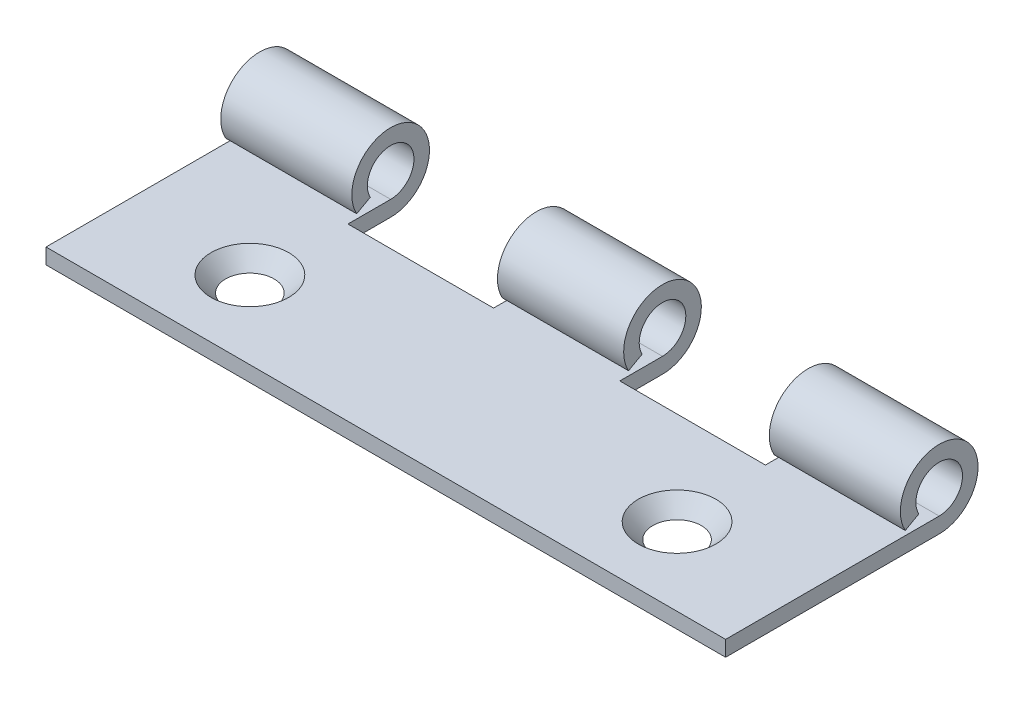
ISO-10303-21;
HEADER;
FILE_DESCRIPTION(('STEP AP214'),'2;1');
FILE_NAME('part.step','',(''),(''),'','','');
FILE_SCHEMA(('AUTOMOTIVE_DESIGN { 1 0 10303 214 1 1 1 1 }'));
ENDSEC;
DATA;
#1=APPLICATION_CONTEXT('core data for automotive mechanical design processes');
#2=APPLICATION_PROTOCOL_DEFINITION('international standard','automotive_design',2000,#1);
#3=PRODUCT_CONTEXT('',#1,'mechanical');
#4=PRODUCT('Part','Part','',(#3));
#5=PRODUCT_RELATED_PRODUCT_CATEGORY('part','',(#4));
#6=PRODUCT_DEFINITION_FORMATION('','',#4);
#7=PRODUCT_DEFINITION_CONTEXT('part definition',#1,'design');
#8=PRODUCT_DEFINITION('design','',#6,#7);
#9=PRODUCT_DEFINITION_SHAPE('','',#8);
#10=(LENGTH_UNIT() NAMED_UNIT(*) SI_UNIT(.MILLI.,.METRE.));
#11=(NAMED_UNIT(*) PLANE_ANGLE_UNIT() SI_UNIT($,.RADIAN.));
#12=(NAMED_UNIT(*) SI_UNIT($,.STERADIAN.) SOLID_ANGLE_UNIT());
#13=UNCERTAINTY_MEASURE_WITH_UNIT(LENGTH_MEASURE(1.E-05),#10,'distance_accuracy_value','');
#14=(GEOMETRIC_REPRESENTATION_CONTEXT(3) GLOBAL_UNCERTAINTY_ASSIGNED_CONTEXT((#13)) GLOBAL_UNIT_ASSIGNED_CONTEXT((#10,
#11,#12)) REPRESENTATION_CONTEXT('',''));
#15=CARTESIAN_POINT('',(0.,0.,0.));
#16=DIRECTION('',(0.,0.,1.));
#17=DIRECTION('',(1.,0.,0.));
#18=AXIS2_PLACEMENT_3D('',#15,#16,#17);
#19=CARTESIAN_POINT('',(0.,0.,0.));
#20=DIRECTION('',(1.,0.,0.));
#21=DIRECTION('',(0.,0.,-1.));
#22=AXIS2_PLACEMENT_3D('',#19,#20,#21);
#23=CYLINDRICAL_SURFACE('',#22,2.);
#24=CARTESIAN_POINT('',(28.25,0.,0.));
#25=DIRECTION('',(1.,0.,0.));
#26=DIRECTION('',(0.,0.,-1.));
#27=AXIS2_PLACEMENT_3D('',#24,#25,#26);
#28=CIRCLE('',#27,2.);
#29=CARTESIAN_POINT('',(28.25,-2.,0.));
#30=VERTEX_POINT('',#29);
#31=CARTESIAN_POINT('',(28.25,-0.969619240492674,1.74923941427879));
#32=VERTEX_POINT('',#31);
#33=EDGE_CURVE('E193',#30,#32,#28,.T.);
#34=ORIENTED_EDGE('',*,*,#33,.T.);
#35=DIRECTION('',(1.,0.,0.));
#36=VECTOR('',#35,1.);
#37=CARTESIAN_POINT('',(0.,-0.969619240492674,1.74923941427879));
#38=LINE('',#37,#36);
#39=CARTESIAN_POINT('',(35.,-0.969619240492674,1.74923941427879));
#40=VERTEX_POINT('',#39);
#41=EDGE_CURVE('E287',#32,#40,#38,.T.);
#42=ORIENTED_EDGE('',*,*,#41,.T.);
#43=CARTESIAN_POINT('',(35.,0.,0.));
#44=DIRECTION('',(-1.,0.,0.));
#45=DIRECTION('',(0.,0.,1.));
#46=AXIS2_PLACEMENT_3D('',#43,#44,#45);
#47=CIRCLE('',#46,2.);
#48=CARTESIAN_POINT('',(35.,-2.,0.));
#49=VERTEX_POINT('',#48);
#50=EDGE_CURVE('E244',#40,#49,#47,.T.);
#51=ORIENTED_EDGE('',*,*,#50,.T.);
#52=DIRECTION('',(1.,0.,0.));
#53=VECTOR('',#52,1.);
#54=CARTESIAN_POINT('',(0.,-2.,0.));
#55=LINE('',#54,#53);
#56=EDGE_CURVE('E314',#30,#49,#55,.T.);
#57=ORIENTED_EDGE('',*,*,#56,.F.);
#58=EDGE_LOOP('',(#34,#42,#51,#57));
#59=FACE_BOUND('',#58,.T.);
#60=ADVANCED_FACE('F15',(#59),#23,.T.);
#61=CARTESIAN_POINT('',(0.,0.,0.));
#62=DIRECTION('',(1.,0.,0.));
#63=DIRECTION('',(0.,0.,-1.));
#64=AXIS2_PLACEMENT_3D('',#61,#62,#63);
#65=CYLINDRICAL_SURFACE('',#64,1.2);
#66=CARTESIAN_POINT('',(28.25,0.,0.));
#67=DIRECTION('',(1.,0.,0.));
#68=DIRECTION('',(0.,0.,-1.));
#69=AXIS2_PLACEMENT_3D('',#66,#67,#68);
#70=CIRCLE('',#69,1.2);
#71=CARTESIAN_POINT('',(28.25,-1.2,0.));
#72=VERTEX_POINT('',#71);
#73=CARTESIAN_POINT('',(28.25,-0.581771544295605,1.04954364856727));
#74=VERTEX_POINT('',#73);
#75=EDGE_CURVE('E186',#72,#74,#70,.T.);
#76=ORIENTED_EDGE('',*,*,#75,.F.);
#77=DIRECTION('',(1.,0.,0.));
#78=VECTOR('',#77,1.);
#79=CARTESIAN_POINT('',(0.,-1.2,0.));
#80=LINE('',#79,#78);
#81=CARTESIAN_POINT('',(35.,-1.2,0.));
#82=VERTEX_POINT('',#81);
#83=EDGE_CURVE('E301',#72,#82,#80,.T.);
#84=ORIENTED_EDGE('',*,*,#83,.T.);
#85=CARTESIAN_POINT('',(35.,0.,0.));
#86=DIRECTION('',(-1.,0.,0.));
#87=DIRECTION('',(0.,0.,1.));
#88=AXIS2_PLACEMENT_3D('',#85,#86,#87);
#89=CIRCLE('',#88,1.2);
#90=CARTESIAN_POINT('',(35.,-0.581771544295604,1.04954364856727));
#91=VERTEX_POINT('',#90);
#92=EDGE_CURVE('E257',#91,#82,#89,.T.);
#93=ORIENTED_EDGE('',*,*,#92,.F.);
#94=DIRECTION('',(1.,0.,0.));
#95=VECTOR('',#94,1.);
#96=CARTESIAN_POINT('',(0.,-0.581771544295604,1.04954364856727));
#97=LINE('',#96,#95);
#98=EDGE_CURVE('E295',#74,#91,#97,.T.);
#99=ORIENTED_EDGE('',*,*,#98,.F.);
#100=EDGE_LOOP('',(#76,#84,#93,#99));
#101=FACE_BOUND('',#100,.T.);
#102=ADVANCED_FACE('F389',(#101),#65,.F.);
#103=CARTESIAN_POINT('',(0.,-0.581771544295604,1.04954364856727));
#104=DIRECTION('',(0.,0.874619707139396,0.484809620246337));
#105=DIRECTION('',(0.,0.484809620246337,-0.874619707139396));
#106=AXIS2_PLACEMENT_3D('',#103,#104,#105);
#107=PLANE('',#106);
#108=ORIENTED_EDGE('',*,*,#41,.F.);
#109=DIRECTION('',(0.,0.484809620246337,-0.874619707139396));
#110=VECTOR('',#109,1.);
#111=CARTESIAN_POINT('',(28.25,-0.581771544295603,1.04954364856727));
#112=LINE('',#111,#110);
#113=EDGE_CURVE('E189',#32,#74,#112,.T.);
#114=ORIENTED_EDGE('',*,*,#113,.T.);
#115=ORIENTED_EDGE('',*,*,#98,.T.);
#116=DIRECTION('',(0.,-0.484809620246337,0.874619707139396));
#117=VECTOR('',#116,1.);
#118=CARTESIAN_POINT('',(35.,-0.581771544295604,1.04954364856727));
#119=LINE('',#118,#117);
#120=EDGE_CURVE('E261',#91,#40,#119,.T.);
#121=ORIENTED_EDGE('',*,*,#120,.T.);
#122=EDGE_LOOP('',(#108,#114,#115,#121));
#123=FACE_BOUND('',#122,.T.);
#124=ADVANCED_FACE('F412',(#123),#107,.F.);
#125=CARTESIAN_POINT('',(14.25,-0.969619240492675,1.74923941427879));
#126=VERTEX_POINT('',#125);
#127=CARTESIAN_POINT('',(20.75,-0.969619240492675,1.74923941427879));
#128=VERTEX_POINT('',#127);
#129=EDGE_CURVE('E296',#126,#128,#38,.T.);
#130=ORIENTED_EDGE('',*,*,#129,.T.);
#131=CARTESIAN_POINT('',(20.75,0.,0.));
#132=DIRECTION('',(-1.,0.,0.));
#133=DIRECTION('',(0.,0.,1.));
#134=AXIS2_PLACEMENT_3D('',#131,#132,#133);
#135=CIRCLE('',#134,2.);
#136=CARTESIAN_POINT('',(20.75,-2.,0.));
#137=VERTEX_POINT('',#136);
#138=EDGE_CURVE('E183',#128,#137,#135,.T.);
#139=ORIENTED_EDGE('',*,*,#138,.T.);
#140=CARTESIAN_POINT('',(14.25,-2.,0.));
#141=VERTEX_POINT('',#140);
#142=EDGE_CURVE('E164',#141,#137,#55,.T.);
#143=ORIENTED_EDGE('',*,*,#142,.F.);
#144=CARTESIAN_POINT('',(14.25,0.,0.));
#145=DIRECTION('',(1.,0.,0.));
#146=DIRECTION('',(0.,0.,-1.));
#147=AXIS2_PLACEMENT_3D('',#144,#145,#146);
#148=CIRCLE('',#147,2.);
#149=EDGE_CURVE('E224',#141,#126,#148,.T.);
#150=ORIENTED_EDGE('',*,*,#149,.T.);
#151=EDGE_LOOP('',(#130,#139,#143,#150));
#152=FACE_BOUND('',#151,.T.);
#153=ADVANCED_FACE('F401',(#152),#23,.T.);
#154=CARTESIAN_POINT('',(20.75,0.,0.));
#155=DIRECTION('',(-1.,0.,0.));
#156=DIRECTION('',(0.,0.,1.));
#157=AXIS2_PLACEMENT_3D('',#154,#155,#156);
#158=CIRCLE('',#157,1.2);
#159=CARTESIAN_POINT('',(20.75,-0.581771544295604,1.04954364856727));
#160=VERTEX_POINT('',#159);
#161=CARTESIAN_POINT('',(20.75,-1.2,0.));
#162=VERTEX_POINT('',#161);
#163=EDGE_CURVE('E31',#160,#162,#158,.T.);
#164=ORIENTED_EDGE('',*,*,#163,.F.);
#165=CARTESIAN_POINT('',(14.25,-0.581771544295603,1.04954364856727));
#166=VERTEX_POINT('',#165);
#167=EDGE_CURVE('E302',#166,#160,#97,.T.);
#168=ORIENTED_EDGE('',*,*,#167,.F.);
#169=CARTESIAN_POINT('',(14.25,0.,0.));
#170=DIRECTION('',(1.,0.,0.));
#171=DIRECTION('',(0.,0.,-1.));
#172=AXIS2_PLACEMENT_3D('',#169,#170,#171);
#173=CIRCLE('',#172,1.2);
#174=CARTESIAN_POINT('',(14.25,-1.2,0.));
#175=VERTEX_POINT('',#174);
#176=EDGE_CURVE('E220',#175,#166,#173,.T.);
#177=ORIENTED_EDGE('',*,*,#176,.F.);
#178=EDGE_CURVE('E308',#175,#162,#80,.T.);
#179=ORIENTED_EDGE('',*,*,#178,.T.);
#180=EDGE_LOOP('',(#164,#168,#177,#179));
#181=FACE_BOUND('',#180,.T.);
#182=ADVANCED_FACE('F352',(#181),#65,.F.);
#183=ORIENTED_EDGE('',*,*,#167,.T.);
#184=DIRECTION('',(0.,-0.484809620246337,0.874619707139396));
#185=VECTOR('',#184,1.);
#186=CARTESIAN_POINT('',(20.75,-0.581771544295603,1.04954364856727));
#187=LINE('',#186,#185);
#188=EDGE_CURVE('E179',#160,#128,#187,.T.);
#189=ORIENTED_EDGE('',*,*,#188,.T.);
#190=ORIENTED_EDGE('',*,*,#129,.F.);
#191=DIRECTION('',(0.,0.484809620246337,-0.874619707139396));
#192=VECTOR('',#191,1.);
#193=CARTESIAN_POINT('',(14.25,-0.581771544295604,1.04954364856727));
#194=LINE('',#193,#192);
#195=EDGE_CURVE('E322',#126,#166,#194,.T.);
#196=ORIENTED_EDGE('',*,*,#195,.T.);
#197=EDGE_LOOP('',(#183,#189,#190,#196));
#198=FACE_BOUND('',#197,.T.);
#199=ADVANCED_FACE('F397',(#198),#107,.F.);
#200=CARTESIAN_POINT('',(0.,-2.,0.));
#201=DIRECTION('',(0.,1.,0.));
#202=DIRECTION('',(-1.,0.,0.));
#203=AXIS2_PLACEMENT_3D('',#200,#201,#202);
#204=PLANE('',#203);
#205=CARTESIAN_POINT('',(28.5,-2.,7.));
#206=DIRECTION('',(0.,-1.,0.));
#207=DIRECTION('',(-1.,0.,0.));
#208=AXIS2_PLACEMENT_3D('',#205,#206,#207);
#209=CIRCLE('',#208,1.25);
#210=CARTESIAN_POINT('',(27.25,-2.,7.));
#211=VERTEX_POINT('',#210);
#212=EDGE_CURVE('E236',#211,#211,#209,.T.);
#213=ORIENTED_EDGE('',*,*,#212,.F.);
#214=EDGE_LOOP('',(#213));
#215=FACE_BOUND('',#214,.T.);
#216=DIRECTION('',(1.,0.,0.));
#217=VECTOR('',#216,1.);
#218=CARTESIAN_POINT('',(20.75,-2.,2.2));
#219=LINE('',#218,#217);
#220=CARTESIAN_POINT('',(20.75,-2.,2.2));
#221=VERTEX_POINT('',#220);
#222=CARTESIAN_POINT('',(28.25,-2.,2.2));
#223=VERTEX_POINT('',#222);
#224=EDGE_CURVE('E149',#221,#223,#219,.T.);
#225=ORIENTED_EDGE('',*,*,#224,.T.);
#226=DIRECTION('',(0.,0.,1.));
#227=VECTOR('',#226,1.);
#228=CARTESIAN_POINT('',(28.25,-2.,0.1));
#229=LINE('',#228,#227);
#230=EDGE_CURVE('E174',#30,#223,#229,.T.);
#231=ORIENTED_EDGE('',*,*,#230,.F.);
#232=ORIENTED_EDGE('',*,*,#56,.T.);
#233=DIRECTION('',(0.,0.,1.));
#234=VECTOR('',#233,1.);
#235=CARTESIAN_POINT('',(35.,-2.,0.));
#236=LINE('',#235,#234);
#237=CARTESIAN_POINT('',(35.,-2.,11.));
#238=VERTEX_POINT('',#237);
#239=EDGE_CURVE('E245',#49,#238,#236,.T.);
#240=ORIENTED_EDGE('',*,*,#239,.T.);
#241=DIRECTION('',(1.,0.,0.));
#242=VECTOR('',#241,1.);
#243=CARTESIAN_POINT('',(0.,-2.,11.));
#244=LINE('',#243,#242);
#245=CARTESIAN_POINT('',(0.,-2.,11.));
#246=VERTEX_POINT('',#245);
#247=EDGE_CURVE('E311',#246,#238,#244,.T.);
#248=ORIENTED_EDGE('',*,*,#247,.F.);
#249=DIRECTION('',(0.,0.,1.));
#250=VECTOR('',#249,1.);
#251=CARTESIAN_POINT('',(0.,-2.,0.));
#252=LINE('',#251,#250);
#253=CARTESIAN_POINT('',(0.,-2.,0.));
#254=VERTEX_POINT('',#253);
#255=EDGE_CURVE('E269',#254,#246,#252,.T.);
#256=ORIENTED_EDGE('',*,*,#255,.F.);
#257=CARTESIAN_POINT('',(6.75,-2.,0.));
#258=VERTEX_POINT('',#257);
#259=EDGE_CURVE('E315',#254,#258,#55,.T.);
#260=ORIENTED_EDGE('',*,*,#259,.T.);
#261=DIRECTION('',(0.,0.,-1.));
#262=VECTOR('',#261,1.);
#263=CARTESIAN_POINT('',(6.75,-2.,0.1));
#264=LINE('',#263,#262);
#265=CARTESIAN_POINT('',(6.75,-2.,2.2));
#266=VERTEX_POINT('',#265);
#267=EDGE_CURVE('E196',#266,#258,#264,.T.);
#268=ORIENTED_EDGE('',*,*,#267,.F.);
#269=DIRECTION('',(1.,0.,0.));
#270=VECTOR('',#269,1.);
#271=CARTESIAN_POINT('',(6.75,-2.,2.2));
#272=LINE('',#271,#270);
#273=CARTESIAN_POINT('',(14.25,-2.,2.2));
#274=VERTEX_POINT('',#273);
#275=EDGE_CURVE('E202',#266,#274,#272,.T.);
#276=ORIENTED_EDGE('',*,*,#275,.T.);
#277=DIRECTION('',(0.,0.,1.));
#278=VECTOR('',#277,1.);
#279=CARTESIAN_POINT('',(14.25,-2.,0.1));
#280=LINE('',#279,#278);
#281=EDGE_CURVE('E210',#141,#274,#280,.T.);
#282=ORIENTED_EDGE('',*,*,#281,.F.);
#283=ORIENTED_EDGE('',*,*,#142,.T.);
#284=DIRECTION('',(0.,0.,-1.));
#285=VECTOR('',#284,1.);
#286=CARTESIAN_POINT('',(20.75,-2.,0.1));
#287=LINE('',#286,#285);
#288=EDGE_CURVE('E143',#221,#137,#287,.T.);
#289=ORIENTED_EDGE('',*,*,#288,.F.);
#290=EDGE_LOOP('',(#225,#231,#232,#240,#248,#256,#260,#268,#276,#282,#283,#289));
#291=FACE_BOUND('',#290,.T.);
#292=CARTESIAN_POINT('',(6.5,-2.,7.));
#293=DIRECTION('',(0.,-1.,0.));
#294=DIRECTION('',(-1.,0.,0.));
#295=AXIS2_PLACEMENT_3D('',#292,#293,#294);
#296=CIRCLE('',#295,1.25);
#297=CARTESIAN_POINT('',(5.25,-2.,7.));
#298=VERTEX_POINT('',#297);
#299=EDGE_CURVE('E227',#298,#298,#296,.T.);
#300=ORIENTED_EDGE('',*,*,#299,.F.);
#301=EDGE_LOOP('',(#300));
#302=FACE_BOUND('',#301,.T.);
#303=ADVANCED_FACE('F160',(#215,#291,#302),#204,.F.);
#304=CARTESIAN_POINT('',(0.,-1.2,0.));
#305=DIRECTION('',(0.,1.,0.));
#306=DIRECTION('',(-1.,0.,0.));
#307=AXIS2_PLACEMENT_3D('',#304,#305,#306);
#308=PLANE('',#307);
#309=DIRECTION('',(0.,0.,-1.));
#310=VECTOR('',#309,1.);
#311=CARTESIAN_POINT('',(28.25,-1.2,0.));
#312=LINE('',#311,#310);
#313=CARTESIAN_POINT('',(28.25,-1.2,2.2));
#314=VERTEX_POINT('',#313);
#315=EDGE_CURVE('E10',#314,#72,#312,.T.);
#316=ORIENTED_EDGE('',*,*,#315,.F.);
#317=DIRECTION('',(1.,0.,0.));
#318=VECTOR('',#317,1.);
#319=CARTESIAN_POINT('',(0.,-1.2,2.2));
#320=LINE('',#319,#318);
#321=CARTESIAN_POINT('',(20.75,-1.2,2.2));
#322=VERTEX_POINT('',#321);
#323=EDGE_CURVE('E24',#322,#314,#320,.T.);
#324=ORIENTED_EDGE('',*,*,#323,.F.);
#325=DIRECTION('',(0.,0.,1.));
#326=VECTOR('',#325,1.);
#327=CARTESIAN_POINT('',(20.75,-1.2,0.));
#328=LINE('',#327,#326);
#329=EDGE_CURVE('E145',#162,#322,#328,.T.);
#330=ORIENTED_EDGE('',*,*,#329,.F.);
#331=ORIENTED_EDGE('',*,*,#178,.F.);
#332=DIRECTION('',(0.,0.,-1.));
#333=VECTOR('',#332,1.);
#334=CARTESIAN_POINT('',(14.25,-1.2,0.));
#335=LINE('',#334,#333);
#336=CARTESIAN_POINT('',(14.25,-1.2,2.2));
#337=VERTEX_POINT('',#336);
#338=EDGE_CURVE('E223',#337,#175,#335,.T.);
#339=ORIENTED_EDGE('',*,*,#338,.F.);
#340=DIRECTION('',(1.,0.,0.));
#341=VECTOR('',#340,1.);
#342=CARTESIAN_POINT('',(0.,-1.2,2.2));
#343=LINE('',#342,#341);
#344=CARTESIAN_POINT('',(6.75,-1.2,2.2));
#345=VERTEX_POINT('',#344);
#346=EDGE_CURVE('E326',#345,#337,#343,.T.);
#347=ORIENTED_EDGE('',*,*,#346,.F.);
#348=DIRECTION('',(0.,0.,1.));
#349=VECTOR('',#348,1.);
#350=CARTESIAN_POINT('',(6.75,-1.2,0.));
#351=LINE('',#350,#349);
#352=CARTESIAN_POINT('',(6.75,-1.2,0.));
#353=VERTEX_POINT('',#352);
#354=EDGE_CURVE('E217',#353,#345,#351,.T.);
#355=ORIENTED_EDGE('',*,*,#354,.F.);
#356=CARTESIAN_POINT('',(0.,-1.2,0.));
#357=VERTEX_POINT('',#356);
#358=EDGE_CURVE('E303',#357,#353,#80,.T.);
#359=ORIENTED_EDGE('',*,*,#358,.F.);
#360=DIRECTION('',(0.,0.,1.));
#361=VECTOR('',#360,1.);
#362=CARTESIAN_POINT('',(0.,-1.2,0.));
#363=LINE('',#362,#361);
#364=CARTESIAN_POINT('',(0.,-1.2,11.));
#365=VERTEX_POINT('',#364);
#366=EDGE_CURVE('E276',#357,#365,#363,.T.);
#367=ORIENTED_EDGE('',*,*,#366,.T.);
#368=DIRECTION('',(1.,0.,0.));
#369=VECTOR('',#368,1.);
#370=CARTESIAN_POINT('',(0.,-1.2,11.));
#371=LINE('',#370,#369);
#372=CARTESIAN_POINT('',(35.,-1.2,11.));
#373=VERTEX_POINT('',#372);
#374=EDGE_CURVE('E307',#365,#373,#371,.T.);
#375=ORIENTED_EDGE('',*,*,#374,.T.);
#376=DIRECTION('',(0.,0.,1.));
#377=VECTOR('',#376,1.);
#378=CARTESIAN_POINT('',(35.,-1.2,0.));
#379=LINE('',#378,#377);
#380=EDGE_CURVE('E253',#82,#373,#379,.T.);
#381=ORIENTED_EDGE('',*,*,#380,.F.);
#382=ORIENTED_EDGE('',*,*,#83,.F.);
#383=EDGE_LOOP('',(#316,#324,#330,#331,#339,#347,#355,#359,#367,#375,#381,#382));
#384=FACE_BOUND('',#383,.T.);
#385=CARTESIAN_POINT('',(28.5,-1.2,7.));
#386=DIRECTION('',(0.,-1.,0.));
#387=DIRECTION('',(-1.,0.,0.));
#388=AXIS2_PLACEMENT_3D('',#385,#386,#387);
#389=CIRCLE('',#388,2.);
#390=CARTESIAN_POINT('',(26.5,-1.2,7.));
#391=VERTEX_POINT('',#390);
#392=EDGE_CURVE('E240',#391,#391,#389,.T.);
#393=ORIENTED_EDGE('',*,*,#392,.T.);
#394=EDGE_LOOP('',(#393));
#395=FACE_BOUND('',#394,.T.);
#396=CARTESIAN_POINT('',(6.5,-1.2,7.));
#397=DIRECTION('',(0.,-1.,0.));
#398=DIRECTION('',(-1.,0.,0.));
#399=AXIS2_PLACEMENT_3D('',#396,#397,#398);
#400=CIRCLE('',#399,2.);
#401=CARTESIAN_POINT('',(4.5,-1.2,7.));
#402=VERTEX_POINT('',#401);
#403=EDGE_CURVE('E232',#402,#402,#400,.T.);
#404=ORIENTED_EDGE('',*,*,#403,.T.);
#405=EDGE_LOOP('',(#404));
#406=FACE_BOUND('',#405,.T.);
#407=ADVANCED_FACE('F338',(#384,#395,#406),#308,.T.);
#408=CARTESIAN_POINT('',(0.,-0.969619240492674,1.74923941427879));
#409=VERTEX_POINT('',#408);
#410=CARTESIAN_POINT('',(6.75,-0.969619240492674,1.74923941427879));
#411=VERTEX_POINT('',#410);
#412=EDGE_CURVE('E291',#409,#411,#38,.T.);
#413=ORIENTED_EDGE('',*,*,#412,.T.);
#414=CARTESIAN_POINT('',(6.75,0.,0.));
#415=DIRECTION('',(-1.,0.,0.));
#416=DIRECTION('',(0.,0.,1.));
#417=AXIS2_PLACEMENT_3D('',#414,#415,#416);
#418=CIRCLE('',#417,2.);
#419=EDGE_CURVE('E39',#411,#258,#418,.T.);
#420=ORIENTED_EDGE('',*,*,#419,.T.);
#421=ORIENTED_EDGE('',*,*,#259,.F.);
#422=CARTESIAN_POINT('',(0.,0.,0.));
#423=DIRECTION('',(-1.,0.,0.));
#424=DIRECTION('',(0.,0.,1.));
#425=AXIS2_PLACEMENT_3D('',#422,#423,#424);
#426=CIRCLE('',#425,2.);
#427=EDGE_CURVE('E265',#409,#254,#426,.T.);
#428=ORIENTED_EDGE('',*,*,#427,.F.);
#429=EDGE_LOOP('',(#413,#420,#421,#428));
#430=FACE_BOUND('',#429,.T.);
#431=ADVANCED_FACE('F17',(#430),#23,.T.);
#432=CARTESIAN_POINT('',(0.,-1.2,11.));
#433=DIRECTION('',(0.,0.,1.));
#434=DIRECTION('',(1.,0.,0.));
#435=AXIS2_PLACEMENT_3D('',#432,#433,#434);
#436=PLANE('',#435);
#437=DIRECTION('',(0.,-1.,0.));
#438=VECTOR('',#437,1.);
#439=CARTESIAN_POINT('',(35.,-1.2,11.));
#440=LINE('',#439,#438);
#441=EDGE_CURVE('E249',#373,#238,#440,.T.);
#442=ORIENTED_EDGE('',*,*,#441,.F.);
#443=ORIENTED_EDGE('',*,*,#374,.F.);
#444=DIRECTION('',(0.,-1.,0.));
#445=VECTOR('',#444,1.);
#446=CARTESIAN_POINT('',(0.,-1.2,11.));
#447=LINE('',#446,#445);
#448=EDGE_CURVE('E272',#365,#246,#447,.T.);
#449=ORIENTED_EDGE('',*,*,#448,.T.);
#450=ORIENTED_EDGE('',*,*,#247,.T.);
#451=EDGE_LOOP('',(#442,#443,#449,#450));
#452=FACE_BOUND('',#451,.T.);
#453=ADVANCED_FACE('F381',(#452),#436,.T.);
#454=CARTESIAN_POINT('',(6.75,0.,0.));
#455=DIRECTION('',(-1.,0.,0.));
#456=DIRECTION('',(0.,0.,1.));
#457=AXIS2_PLACEMENT_3D('',#454,#455,#456);
#458=CIRCLE('',#457,1.2);
#459=CARTESIAN_POINT('',(6.75,-0.581771544295604,1.04954364856727));
#460=VERTEX_POINT('',#459);
#461=EDGE_CURVE('E212',#460,#353,#458,.T.);
#462=ORIENTED_EDGE('',*,*,#461,.F.);
#463=CARTESIAN_POINT('',(0.,-0.581771544295604,1.04954364856727));
#464=VERTEX_POINT('',#463);
#465=EDGE_CURVE('E297',#464,#460,#97,.T.);
#466=ORIENTED_EDGE('',*,*,#465,.F.);
#467=CARTESIAN_POINT('',(0.,0.,0.));
#468=DIRECTION('',(-1.,0.,0.));
#469=DIRECTION('',(0.,0.,1.));
#470=AXIS2_PLACEMENT_3D('',#467,#468,#469);
#471=CIRCLE('',#470,1.2);
#472=EDGE_CURVE('E280',#464,#357,#471,.T.);
#473=ORIENTED_EDGE('',*,*,#472,.T.);
#474=ORIENTED_EDGE('',*,*,#358,.T.);
#475=EDGE_LOOP('',(#462,#466,#473,#474));
#476=FACE_BOUND('',#475,.T.);
#477=ADVANCED_FACE('F372',(#476),#65,.F.);
#478=ORIENTED_EDGE('',*,*,#465,.T.);
#479=DIRECTION('',(0.,-0.484809620246337,0.874619707139396));
#480=VECTOR('',#479,1.);
#481=CARTESIAN_POINT('',(6.75,-0.581771544295604,1.04954364856727));
#482=LINE('',#481,#480);
#483=EDGE_CURVE('E319',#460,#411,#482,.T.);
#484=ORIENTED_EDGE('',*,*,#483,.T.);
#485=ORIENTED_EDGE('',*,*,#412,.F.);
#486=DIRECTION('',(0.,-0.484809620246337,0.874619707139396));
#487=VECTOR('',#486,1.);
#488=CARTESIAN_POINT('',(0.,-0.581771544295604,1.04954364856727));
#489=LINE('',#488,#487);
#490=EDGE_CURVE('E284',#464,#409,#489,.T.);
#491=ORIENTED_EDGE('',*,*,#490,.F.);
#492=EDGE_LOOP('',(#478,#484,#485,#491));
#493=FACE_BOUND('',#492,.T.);
#494=ADVANCED_FACE('F415',(#493),#107,.F.);
#495=CARTESIAN_POINT('',(0.,0.,0.));
#496=DIRECTION('',(-1.,0.,0.));
#497=DIRECTION('',(0.,0.,1.));
#498=AXIS2_PLACEMENT_3D('',#495,#496,#497);
#499=PLANE('',#498);
#500=ORIENTED_EDGE('',*,*,#427,.T.);
#501=ORIENTED_EDGE('',*,*,#255,.T.);
#502=ORIENTED_EDGE('',*,*,#448,.F.);
#503=ORIENTED_EDGE('',*,*,#366,.F.);
#504=ORIENTED_EDGE('',*,*,#472,.F.);
#505=ORIENTED_EDGE('',*,*,#490,.T.);
#506=EDGE_LOOP('',(#500,#501,#502,#503,#504,#505));
#507=FACE_BOUND('',#506,.T.);
#508=ADVANCED_FACE('F376',(#507),#499,.T.);
#509=CARTESIAN_POINT('',(35.,0.,0.));
#510=DIRECTION('',(-1.,0.,0.));
#511=DIRECTION('',(0.,0.,1.));
#512=AXIS2_PLACEMENT_3D('',#509,#510,#511);
#513=PLANE('',#512);
#514=ORIENTED_EDGE('',*,*,#50,.F.);
#515=ORIENTED_EDGE('',*,*,#120,.F.);
#516=ORIENTED_EDGE('',*,*,#92,.T.);
#517=ORIENTED_EDGE('',*,*,#380,.T.);
#518=ORIENTED_EDGE('',*,*,#441,.T.);
#519=ORIENTED_EDGE('',*,*,#239,.F.);
#520=EDGE_LOOP('',(#514,#515,#516,#517,#518,#519));
#521=FACE_BOUND('',#520,.T.);
#522=ADVANCED_FACE('F386',(#521),#513,.F.);
#523=CARTESIAN_POINT('',(28.5,-1.2,7.));
#524=DIRECTION('',(0.,1.,0.));
#525=DIRECTION('',(1.,0.,0.));
#526=AXIS2_PLACEMENT_3D('',#523,#524,#525);
#527=CONICAL_SURFACE('',#526,2.,0.753151280962195);
#528=ORIENTED_EDGE('',*,*,#212,.T.);
#529=EDGE_LOOP('',(#528));
#530=FACE_BOUND('',#529,.T.);
#531=ORIENTED_EDGE('',*,*,#392,.F.);
#532=EDGE_LOOP('',(#531));
#533=FACE_BOUND('',#532,.T.);
#534=ADVANCED_FACE('F505',(#530,#533),#527,.F.);
#535=CARTESIAN_POINT('',(6.5,-1.2,7.));
#536=DIRECTION('',(0.,1.,0.));
#537=DIRECTION('',(1.,0.,0.));
#538=AXIS2_PLACEMENT_3D('',#535,#536,#537);
#539=CONICAL_SURFACE('',#538,2.,0.753151280962195);
#540=ORIENTED_EDGE('',*,*,#299,.T.);
#541=EDGE_LOOP('',(#540));
#542=FACE_BOUND('',#541,.T.);
#543=ORIENTED_EDGE('',*,*,#403,.F.);
#544=EDGE_LOOP('',(#543));
#545=FACE_BOUND('',#544,.T.);
#546=ADVANCED_FACE('F514',(#542,#545),#539,.F.);
#547=CARTESIAN_POINT('',(14.25,0.,0.1));
#548=DIRECTION('',(1.,0.,0.));
#549=DIRECTION('',(0.,0.,-1.));
#550=AXIS2_PLACEMENT_3D('',#547,#548,#549);
#551=PLANE('',#550);
#552=ORIENTED_EDGE('',*,*,#281,.T.);
#553=DIRECTION('',(0.,1.,0.));
#554=VECTOR('',#553,1.);
#555=CARTESIAN_POINT('',(14.25,0.,2.2));
#556=LINE('',#555,#554);
#557=EDGE_CURVE('E206',#274,#337,#556,.T.);
#558=ORIENTED_EDGE('',*,*,#557,.T.);
#559=ORIENTED_EDGE('',*,*,#338,.T.);
#560=ORIENTED_EDGE('',*,*,#176,.T.);
#561=ORIENTED_EDGE('',*,*,#195,.F.);
#562=ORIENTED_EDGE('',*,*,#149,.F.);
#563=EDGE_LOOP('',(#552,#558,#559,#560,#561,#562));
#564=FACE_BOUND('',#563,.T.);
#565=ADVANCED_FACE('F359',(#564),#551,.F.);
#566=CARTESIAN_POINT('',(6.75,0.,0.1));
#567=DIRECTION('',(-1.,0.,0.));
#568=DIRECTION('',(0.,0.,1.));
#569=AXIS2_PLACEMENT_3D('',#566,#567,#568);
#570=PLANE('',#569);
#571=ORIENTED_EDGE('',*,*,#419,.F.);
#572=ORIENTED_EDGE('',*,*,#483,.F.);
#573=ORIENTED_EDGE('',*,*,#461,.T.);
#574=ORIENTED_EDGE('',*,*,#354,.T.);
#575=DIRECTION('',(0.,-1.,0.));
#576=VECTOR('',#575,1.);
#577=CARTESIAN_POINT('',(6.75,0.,2.2));
#578=LINE('',#577,#576);
#579=EDGE_CURVE('E199',#345,#266,#578,.T.);
#580=ORIENTED_EDGE('',*,*,#579,.T.);
#581=ORIENTED_EDGE('',*,*,#267,.T.);
#582=EDGE_LOOP('',(#571,#572,#573,#574,#580,#581));
#583=FACE_BOUND('',#582,.T.);
#584=ADVANCED_FACE('F368',(#583),#570,.F.);
#585=CARTESIAN_POINT('',(6.75,0.,2.2));
#586=DIRECTION('',(0.,0.,1.));
#587=DIRECTION('',(1.,0.,0.));
#588=AXIS2_PLACEMENT_3D('',#585,#586,#587);
#589=PLANE('',#588);
#590=ORIENTED_EDGE('',*,*,#346,.T.);
#591=ORIENTED_EDGE('',*,*,#557,.F.);
#592=ORIENTED_EDGE('',*,*,#275,.F.);
#593=ORIENTED_EDGE('',*,*,#579,.F.);
#594=EDGE_LOOP('',(#590,#591,#592,#593));
#595=FACE_BOUND('',#594,.T.);
#596=ADVANCED_FACE('F364',(#595),#589,.F.);
#597=CARTESIAN_POINT('',(28.25,0.,0.1));
#598=DIRECTION('',(1.,0.,0.));
#599=DIRECTION('',(0.,0.,-1.));
#600=AXIS2_PLACEMENT_3D('',#597,#598,#599);
#601=PLANE('',#600);
#602=ORIENTED_EDGE('',*,*,#230,.T.);
#603=DIRECTION('',(0.,1.,0.));
#604=VECTOR('',#603,1.);
#605=CARTESIAN_POINT('',(28.25,0.,2.2));
#606=LINE('',#605,#604);
#607=EDGE_CURVE('E155',#223,#314,#606,.T.);
#608=ORIENTED_EDGE('',*,*,#607,.T.);
#609=ORIENTED_EDGE('',*,*,#315,.T.);
#610=ORIENTED_EDGE('',*,*,#75,.T.);
#611=ORIENTED_EDGE('',*,*,#113,.F.);
#612=ORIENTED_EDGE('',*,*,#33,.F.);
#613=EDGE_LOOP('',(#602,#608,#609,#610,#611,#612));
#614=FACE_BOUND('',#613,.T.);
#615=ADVANCED_FACE('F335',(#614),#601,.F.);
#616=CARTESIAN_POINT('',(20.75,0.,0.1));
#617=DIRECTION('',(-1.,0.,0.));
#618=DIRECTION('',(0.,0.,1.));
#619=AXIS2_PLACEMENT_3D('',#616,#617,#618);
#620=PLANE('',#619);
#621=ORIENTED_EDGE('',*,*,#138,.F.);
#622=ORIENTED_EDGE('',*,*,#188,.F.);
#623=ORIENTED_EDGE('',*,*,#163,.T.);
#624=ORIENTED_EDGE('',*,*,#329,.T.);
#625=DIRECTION('',(0.,-1.,0.));
#626=VECTOR('',#625,1.);
#627=CARTESIAN_POINT('',(20.75,0.,2.2));
#628=LINE('',#627,#626);
#629=EDGE_CURVE('E139',#322,#221,#628,.T.);
#630=ORIENTED_EDGE('',*,*,#629,.T.);
#631=ORIENTED_EDGE('',*,*,#288,.T.);
#632=EDGE_LOOP('',(#621,#622,#623,#624,#630,#631));
#633=FACE_BOUND('',#632,.T.);
#634=ADVANCED_FACE('F141',(#633),#620,.F.);
#635=CARTESIAN_POINT('',(20.75,0.,2.2));
#636=DIRECTION('',(0.,0.,1.));
#637=DIRECTION('',(1.,0.,0.));
#638=AXIS2_PLACEMENT_3D('',#635,#636,#637);
#639=PLANE('',#638);
#640=ORIENTED_EDGE('',*,*,#323,.T.);
#641=ORIENTED_EDGE('',*,*,#607,.F.);
#642=ORIENTED_EDGE('',*,*,#224,.F.);
#643=ORIENTED_EDGE('',*,*,#629,.F.);
#644=EDGE_LOOP('',(#640,#641,#642,#643));
#645=FACE_BOUND('',#644,.T.);
#646=ADVANCED_FACE('F153',(#645),#639,.F.);
#647=CLOSED_SHELL('',(#60,#102,#124,#153,#182,#199,#303,#407,#431,#453,#477,#494,#508,#522,#534,
#546,#565,#584,#596,#615,#634,#646));
#648=MANIFOLD_SOLID_BREP('B1',#647);
#649=ADVANCED_BREP_SHAPE_REPRESENTATION('',(#18,#648),#14);
#650=SHAPE_DEFINITION_REPRESENTATION(#9,#649);
ENDSEC;
END-ISO-10303-21;
